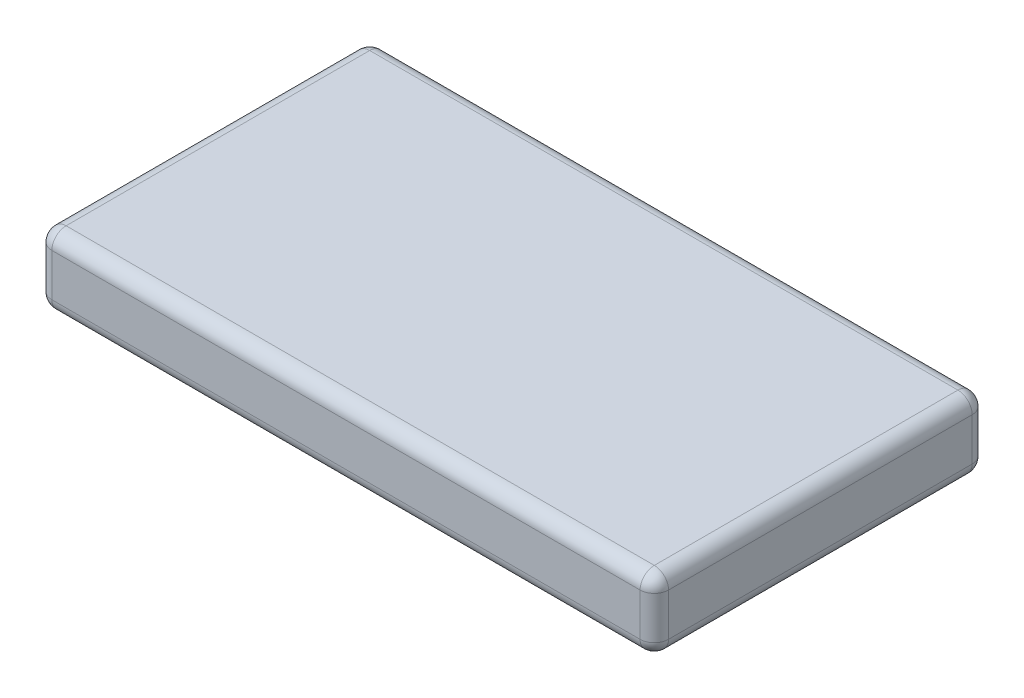
ISO-10303-21;
HEADER;
FILE_DESCRIPTION(('STEP AP214'),'2;1');
FILE_NAME('part.step','',(''),(''),'','','');
FILE_SCHEMA(('AUTOMOTIVE_DESIGN { 1 0 10303 214 1 1 1 1 }'));
ENDSEC;
DATA;
#1=APPLICATION_CONTEXT('core data for automotive mechanical design processes');
#2=APPLICATION_PROTOCOL_DEFINITION('international standard','automotive_design',2000,#1);
#3=PRODUCT_CONTEXT('',#1,'mechanical');
#4=PRODUCT('Part','Part','',(#3));
#5=PRODUCT_RELATED_PRODUCT_CATEGORY('part','',(#4));
#6=PRODUCT_DEFINITION_FORMATION('','',#4);
#7=PRODUCT_DEFINITION_CONTEXT('part definition',#1,'design');
#8=PRODUCT_DEFINITION('design','',#6,#7);
#9=PRODUCT_DEFINITION_SHAPE('','',#8);
#10=(LENGTH_UNIT() NAMED_UNIT(*) SI_UNIT(.MILLI.,.METRE.));
#11=(NAMED_UNIT(*) PLANE_ANGLE_UNIT() SI_UNIT($,.RADIAN.));
#12=(NAMED_UNIT(*) SI_UNIT($,.STERADIAN.) SOLID_ANGLE_UNIT());
#13=UNCERTAINTY_MEASURE_WITH_UNIT(LENGTH_MEASURE(1.E-05),#10,'distance_accuracy_value','');
#14=(GEOMETRIC_REPRESENTATION_CONTEXT(3) GLOBAL_UNCERTAINTY_ASSIGNED_CONTEXT((#13)) GLOBAL_UNIT_ASSIGNED_CONTEXT((#10,
#11,#12)) REPRESENTATION_CONTEXT('',''));
#15=CARTESIAN_POINT('',(0.,0.,0.));
#16=DIRECTION('',(0.,0.,1.));
#17=DIRECTION('',(1.,0.,0.));
#18=AXIS2_PLACEMENT_3D('',#15,#16,#17);
#19=CARTESIAN_POINT('',(65.,15.,-35.));
#20=DIRECTION('',(-1.,0.,0.));
#21=DIRECTION('',(0.,0.,1.));
#22=AXIS2_PLACEMENT_3D('',#19,#20,#21);
#23=PLANE('',#22);
#24=DIRECTION('',(0.,-1.,0.));
#25=VECTOR('',#24,1.);
#26=CARTESIAN_POINT('',(65.,15.,32.));
#27=LINE('',#26,#25);
#28=CARTESIAN_POINT('',(65.,12.,32.));
#29=VERTEX_POINT('',#28);
#30=CARTESIAN_POINT('',(65.,3.,32.));
#31=VERTEX_POINT('',#30);
#32=EDGE_CURVE('E132',#29,#31,#27,.T.);
#33=ORIENTED_EDGE('',*,*,#32,.T.);
#34=DIRECTION('',(0.,0.,-1.));
#35=VECTOR('',#34,1.);
#36=CARTESIAN_POINT('',(65.,3.,-35.));
#37=LINE('',#36,#35);
#38=CARTESIAN_POINT('',(65.,3.,-32.));
#39=VERTEX_POINT('',#38);
#40=EDGE_CURVE('E128',#31,#39,#37,.T.);
#41=ORIENTED_EDGE('',*,*,#40,.T.);
#42=DIRECTION('',(0.,-1.,0.));
#43=VECTOR('',#42,1.);
#44=CARTESIAN_POINT('',(65.,15.,-32.));
#45=LINE('',#44,#43);
#46=CARTESIAN_POINT('',(65.,12.,-32.));
#47=VERTEX_POINT('',#46);
#48=EDGE_CURVE('E121',#39,#47,#45,.F.);
#49=ORIENTED_EDGE('',*,*,#48,.T.);
#50=DIRECTION('',(0.,0.,-1.));
#51=VECTOR('',#50,1.);
#52=CARTESIAN_POINT('',(65.,12.,35.));
#53=LINE('',#52,#51);
#54=EDGE_CURVE('E125',#47,#29,#53,.F.);
#55=ORIENTED_EDGE('',*,*,#54,.T.);
#56=EDGE_LOOP('',(#33,#41,#49,#55));
#57=FACE_BOUND('',#56,.T.);
#58=ADVANCED_FACE('F33',(#57),#23,.F.);
#59=CARTESIAN_POINT('',(-65.,15.,-35.));
#60=DIRECTION('',(0.,0.,1.));
#61=DIRECTION('',(1.,0.,0.));
#62=AXIS2_PLACEMENT_3D('',#59,#60,#61);
#63=PLANE('',#62);
#64=DIRECTION('',(0.,-1.,0.));
#65=VECTOR('',#64,1.);
#66=CARTESIAN_POINT('',(62.,15.,-35.));
#67=LINE('',#66,#65);
#68=CARTESIAN_POINT('',(62.,12.,-35.));
#69=VERTEX_POINT('',#68);
#70=CARTESIAN_POINT('',(62.,3.,-35.));
#71=VERTEX_POINT('',#70);
#72=EDGE_CURVE('E140',#69,#71,#67,.T.);
#73=ORIENTED_EDGE('',*,*,#72,.T.);
#74=DIRECTION('',(-1.,0.,0.));
#75=VECTOR('',#74,1.);
#76=CARTESIAN_POINT('',(-65.,3.,-35.));
#77=LINE('',#76,#75);
#78=CARTESIAN_POINT('',(-62.,3.,-35.));
#79=VERTEX_POINT('',#78);
#80=EDGE_CURVE('E178',#71,#79,#77,.T.);
#81=ORIENTED_EDGE('',*,*,#80,.T.);
#82=DIRECTION('',(0.,-1.,0.));
#83=VECTOR('',#82,1.);
#84=CARTESIAN_POINT('',(-62.,15.,-35.));
#85=LINE('',#84,#83);
#86=CARTESIAN_POINT('',(-62.,12.,-35.));
#87=VERTEX_POINT('',#86);
#88=EDGE_CURVE('E175',#79,#87,#85,.F.);
#89=ORIENTED_EDGE('',*,*,#88,.T.);
#90=DIRECTION('',(-1.,0.,0.));
#91=VECTOR('',#90,1.);
#92=CARTESIAN_POINT('',(65.,12.,-35.));
#93=LINE('',#92,#91);
#94=EDGE_CURVE('E173',#87,#69,#93,.F.);
#95=ORIENTED_EDGE('',*,*,#94,.T.);
#96=EDGE_LOOP('',(#73,#81,#89,#95));
#97=FACE_BOUND('',#96,.T.);
#98=ADVANCED_FACE('F295',(#97),#63,.F.);
#99=CARTESIAN_POINT('',(-65.,15.,-35.));
#100=DIRECTION('',(1.,0.,0.));
#101=DIRECTION('',(0.,0.,-1.));
#102=AXIS2_PLACEMENT_3D('',#99,#100,#101);
#103=PLANE('',#102);
#104=DIRECTION('',(0.,-1.,0.));
#105=VECTOR('',#104,1.);
#106=CARTESIAN_POINT('',(-65.,15.,-32.));
#107=LINE('',#106,#105);
#108=CARTESIAN_POINT('',(-65.,12.,-32.));
#109=VERTEX_POINT('',#108);
#110=CARTESIAN_POINT('',(-65.,3.,-32.));
#111=VERTEX_POINT('',#110);
#112=EDGE_CURVE('E184',#109,#111,#107,.T.);
#113=ORIENTED_EDGE('',*,*,#112,.T.);
#114=DIRECTION('',(0.,0.,1.));
#115=VECTOR('',#114,1.);
#116=CARTESIAN_POINT('',(-65.,3.,-35.));
#117=LINE('',#116,#115);
#118=CARTESIAN_POINT('',(-65.,3.,32.));
#119=VERTEX_POINT('',#118);
#120=EDGE_CURVE('E187',#111,#119,#117,.T.);
#121=ORIENTED_EDGE('',*,*,#120,.T.);
#122=DIRECTION('',(0.,-1.,0.));
#123=VECTOR('',#122,1.);
#124=CARTESIAN_POINT('',(-65.,15.,32.));
#125=LINE('',#124,#123);
#126=CARTESIAN_POINT('',(-65.,12.,32.));
#127=VERTEX_POINT('',#126);
#128=EDGE_CURVE('E182',#119,#127,#125,.F.);
#129=ORIENTED_EDGE('',*,*,#128,.T.);
#130=DIRECTION('',(0.,0.,1.));
#131=VECTOR('',#130,1.);
#132=CARTESIAN_POINT('',(-65.,12.,-35.));
#133=LINE('',#132,#131);
#134=EDGE_CURVE('E180',#127,#109,#133,.F.);
#135=ORIENTED_EDGE('',*,*,#134,.T.);
#136=EDGE_LOOP('',(#113,#121,#129,#135));
#137=FACE_BOUND('',#136,.T.);
#138=ADVANCED_FACE('F272',(#137),#103,.F.);
#139=CARTESIAN_POINT('',(-65.,15.,35.));
#140=DIRECTION('',(0.,0.,-1.));
#141=DIRECTION('',(-1.,0.,0.));
#142=AXIS2_PLACEMENT_3D('',#139,#140,#141);
#143=PLANE('',#142);
#144=DIRECTION('',(0.,-1.,0.));
#145=VECTOR('',#144,1.);
#146=CARTESIAN_POINT('',(-62.,15.,35.));
#147=LINE('',#146,#145);
#148=CARTESIAN_POINT('',(-62.,12.,35.));
#149=VERTEX_POINT('',#148);
#150=CARTESIAN_POINT('',(-62.,3.,35.));
#151=VERTEX_POINT('',#150);
#152=EDGE_CURVE('E166',#149,#151,#147,.T.);
#153=ORIENTED_EDGE('',*,*,#152,.T.);
#154=DIRECTION('',(1.,0.,0.));
#155=VECTOR('',#154,1.);
#156=CARTESIAN_POINT('',(-65.,3.,35.));
#157=LINE('',#156,#155);
#158=CARTESIAN_POINT('',(62.,3.,35.));
#159=VERTEX_POINT('',#158);
#160=EDGE_CURVE('E171',#151,#159,#157,.T.);
#161=ORIENTED_EDGE('',*,*,#160,.T.);
#162=DIRECTION('',(0.,-1.,0.));
#163=VECTOR('',#162,1.);
#164=CARTESIAN_POINT('',(62.,15.,35.));
#165=LINE('',#164,#163);
#166=CARTESIAN_POINT('',(62.,12.,35.));
#167=VERTEX_POINT('',#166);
#168=EDGE_CURVE('E168',#159,#167,#165,.F.);
#169=ORIENTED_EDGE('',*,*,#168,.T.);
#170=DIRECTION('',(1.,0.,0.));
#171=VECTOR('',#170,1.);
#172=CARTESIAN_POINT('',(-65.,12.,35.));
#173=LINE('',#172,#171);
#174=EDGE_CURVE('E164',#167,#149,#173,.F.);
#175=ORIENTED_EDGE('',*,*,#174,.T.);
#176=EDGE_LOOP('',(#153,#161,#169,#175));
#177=FACE_BOUND('',#176,.T.);
#178=ADVANCED_FACE('F302',(#177),#143,.F.);
#179=CARTESIAN_POINT('',(0.,15.,0.));
#180=DIRECTION('',(0.,1.,0.));
#181=DIRECTION('',(0.,0.,1.));
#182=AXIS2_PLACEMENT_3D('',#179,#180,#181);
#183=PLANE('',#182);
#184=DIRECTION('',(0.,0.,1.));
#185=VECTOR('',#184,1.);
#186=CARTESIAN_POINT('',(-62.,15.,35.));
#187=LINE('',#186,#185);
#188=CARTESIAN_POINT('',(-62.,15.,-32.));
#189=VERTEX_POINT('',#188);
#190=CARTESIAN_POINT('',(-62.,15.,32.));
#191=VERTEX_POINT('',#190);
#192=EDGE_CURVE('E42',#189,#191,#187,.T.);
#193=ORIENTED_EDGE('',*,*,#192,.T.);
#194=DIRECTION('',(1.,0.,0.));
#195=VECTOR('',#194,1.);
#196=CARTESIAN_POINT('',(65.,15.,32.));
#197=LINE('',#196,#195);
#198=CARTESIAN_POINT('',(62.,15.,32.));
#199=VERTEX_POINT('',#198);
#200=EDGE_CURVE('E11',#191,#199,#197,.T.);
#201=ORIENTED_EDGE('',*,*,#200,.T.);
#202=DIRECTION('',(0.,0.,-1.));
#203=VECTOR('',#202,1.);
#204=CARTESIAN_POINT('',(62.,15.,-35.));
#205=LINE('',#204,#203);
#206=CARTESIAN_POINT('',(62.,15.,-32.));
#207=VERTEX_POINT('',#206);
#208=EDGE_CURVE('E198',#199,#207,#205,.T.);
#209=ORIENTED_EDGE('',*,*,#208,.T.);
#210=DIRECTION('',(-1.,0.,0.));
#211=VECTOR('',#210,1.);
#212=CARTESIAN_POINT('',(-65.,15.,-32.));
#213=LINE('',#212,#211);
#214=EDGE_CURVE('E53',#207,#189,#213,.T.);
#215=ORIENTED_EDGE('',*,*,#214,.T.);
#216=EDGE_LOOP('',(#193,#201,#209,#215));
#217=FACE_BOUND('',#216,.T.);
#218=ADVANCED_FACE('F365',(#217),#183,.T.);
#219=CARTESIAN_POINT('',(0.,0.,0.));
#220=DIRECTION('',(0.,1.,0.));
#221=DIRECTION('',(0.,0.,1.));
#222=AXIS2_PLACEMENT_3D('',#219,#220,#221);
#223=PLANE('',#222);
#224=DIRECTION('',(0.,0.,1.));
#225=VECTOR('',#224,1.);
#226=CARTESIAN_POINT('',(-62.,0.,0.));
#227=LINE('',#226,#225);
#228=CARTESIAN_POINT('',(-62.,0.,32.));
#229=VERTEX_POINT('',#228);
#230=CARTESIAN_POINT('',(-62.,0.,-32.));
#231=VERTEX_POINT('',#230);
#232=EDGE_CURVE('E193',#229,#231,#227,.F.);
#233=ORIENTED_EDGE('',*,*,#232,.T.);
#234=DIRECTION('',(-1.,0.,0.));
#235=VECTOR('',#234,1.);
#236=CARTESIAN_POINT('',(0.,0.,-32.));
#237=LINE('',#236,#235);
#238=CARTESIAN_POINT('',(62.,0.,-32.));
#239=VERTEX_POINT('',#238);
#240=EDGE_CURVE('E195',#231,#239,#237,.F.);
#241=ORIENTED_EDGE('',*,*,#240,.T.);
#242=DIRECTION('',(0.,0.,-1.));
#243=VECTOR('',#242,1.);
#244=CARTESIAN_POINT('',(62.,0.,0.));
#245=LINE('',#244,#243);
#246=CARTESIAN_POINT('',(62.,0.,32.));
#247=VERTEX_POINT('',#246);
#248=EDGE_CURVE('E189',#239,#247,#245,.F.);
#249=ORIENTED_EDGE('',*,*,#248,.T.);
#250=DIRECTION('',(1.,0.,0.));
#251=VECTOR('',#250,1.);
#252=CARTESIAN_POINT('',(0.,0.,32.));
#253=LINE('',#252,#251);
#254=EDGE_CURVE('E191',#247,#229,#253,.F.);
#255=ORIENTED_EDGE('',*,*,#254,.T.);
#256=EDGE_LOOP('',(#233,#241,#249,#255));
#257=FACE_BOUND('',#256,.T.);
#258=ADVANCED_FACE('F264',(#257),#223,.F.);
#259=CARTESIAN_POINT('',(-62.,15.,-32.));
#260=DIRECTION('',(0.,-1.,0.));
#261=DIRECTION('',(0.,0.,-1.));
#262=AXIS2_PLACEMENT_3D('',#259,#260,#261);
#263=CYLINDRICAL_SURFACE('',#262,3.);
#264=CARTESIAN_POINT('',(-62.,12.,-32.));
#265=DIRECTION('',(0.,1.,0.));
#266=DIRECTION('',(0.,0.,1.));
#267=AXIS2_PLACEMENT_3D('',#264,#265,#266);
#268=CIRCLE('',#267,3.);
#269=EDGE_CURVE('E37',#87,#109,#268,.T.);
#270=ORIENTED_EDGE('',*,*,#269,.F.);
#271=ORIENTED_EDGE('',*,*,#88,.F.);
#272=CARTESIAN_POINT('',(-62.,3.,-32.));
#273=DIRECTION('',(0.,-1.,0.));
#274=DIRECTION('',(0.,0.,-1.));
#275=AXIS2_PLACEMENT_3D('',#272,#273,#274);
#276=CIRCLE('',#275,3.);
#277=EDGE_CURVE('E160',#111,#79,#276,.T.);
#278=ORIENTED_EDGE('',*,*,#277,.F.);
#279=ORIENTED_EDGE('',*,*,#112,.F.);
#280=EDGE_LOOP('',(#270,#271,#278,#279));
#281=FACE_BOUND('',#280,.T.);
#282=ADVANCED_FACE('F35',(#281),#263,.T.);
#283=CARTESIAN_POINT('',(-62.,12.,-32.));
#284=DIRECTION('',(0.,0.,1.));
#285=DIRECTION('',(1.,0.,0.));
#286=AXIS2_PLACEMENT_3D('',#283,#284,#285);
#287=SPHERICAL_SURFACE('',#286,3.);
#288=CARTESIAN_POINT('',(-62.,12.,-32.));
#289=DIRECTION('',(-1.,0.,0.));
#290=DIRECTION('',(0.,0.,1.));
#291=AXIS2_PLACEMENT_3D('',#288,#289,#290);
#292=CIRCLE('',#291,3.);
#293=EDGE_CURVE('E245',#87,#189,#292,.F.);
#294=ORIENTED_EDGE('',*,*,#293,.F.);
#295=ORIENTED_EDGE('',*,*,#269,.T.);
#296=CARTESIAN_POINT('',(-62.,12.,-32.));
#297=DIRECTION('',(0.,0.,-1.));
#298=DIRECTION('',(-1.,0.,0.));
#299=AXIS2_PLACEMENT_3D('',#296,#297,#298);
#300=CIRCLE('',#299,3.);
#301=EDGE_CURVE('E247',#189,#109,#300,.F.);
#302=ORIENTED_EDGE('',*,*,#301,.F.);
#303=EDGE_LOOP('',(#294,#295,#302));
#304=FACE_BOUND('',#303,.T.);
#305=ADVANCED_FACE('F290',(#304),#287,.T.);
#306=CARTESIAN_POINT('',(-62.,3.,-32.));
#307=DIRECTION('',(0.,0.,1.));
#308=DIRECTION('',(1.,0.,0.));
#309=AXIS2_PLACEMENT_3D('',#306,#307,#308);
#310=SPHERICAL_SURFACE('',#309,3.);
#311=CARTESIAN_POINT('',(-62.,3.,-32.));
#312=DIRECTION('',(0.,0.,-1.));
#313=DIRECTION('',(-1.,0.,0.));
#314=AXIS2_PLACEMENT_3D('',#311,#312,#313);
#315=CIRCLE('',#314,3.);
#316=EDGE_CURVE('E239',#111,#231,#315,.F.);
#317=ORIENTED_EDGE('',*,*,#316,.F.);
#318=ORIENTED_EDGE('',*,*,#277,.T.);
#319=CARTESIAN_POINT('',(-62.,3.,-32.));
#320=DIRECTION('',(-1.,0.,0.));
#321=DIRECTION('',(0.,0.,1.));
#322=AXIS2_PLACEMENT_3D('',#319,#320,#321);
#323=CIRCLE('',#322,3.);
#324=EDGE_CURVE('E242',#231,#79,#323,.F.);
#325=ORIENTED_EDGE('',*,*,#324,.F.);
#326=EDGE_LOOP('',(#317,#318,#325));
#327=FACE_BOUND('',#326,.T.);
#328=ADVANCED_FACE('F254',(#327),#310,.T.);
#329=CARTESIAN_POINT('',(-62.,12.,0.));
#330=DIRECTION('',(0.,0.,-1.));
#331=DIRECTION('',(-1.,0.,0.));
#332=AXIS2_PLACEMENT_3D('',#329,#330,#331);
#333=CYLINDRICAL_SURFACE('',#332,3.);
#334=ORIENTED_EDGE('',*,*,#301,.T.);
#335=ORIENTED_EDGE('',*,*,#134,.F.);
#336=CARTESIAN_POINT('',(-62.,12.,32.));
#337=DIRECTION('',(0.,0.,1.));
#338=DIRECTION('',(1.,0.,0.));
#339=AXIS2_PLACEMENT_3D('',#336,#337,#338);
#340=CIRCLE('',#339,3.);
#341=EDGE_CURVE('E233',#191,#127,#340,.T.);
#342=ORIENTED_EDGE('',*,*,#341,.F.);
#343=ORIENTED_EDGE('',*,*,#192,.F.);
#344=EDGE_LOOP('',(#334,#335,#342,#343));
#345=FACE_BOUND('',#344,.T.);
#346=ADVANCED_FACE('F285',(#345),#333,.T.);
#347=CARTESIAN_POINT('',(0.,12.,-32.));
#348=DIRECTION('',(1.,0.,0.));
#349=DIRECTION('',(0.,0.,-1.));
#350=AXIS2_PLACEMENT_3D('',#347,#348,#349);
#351=CYLINDRICAL_SURFACE('',#350,3.);
#352=ORIENTED_EDGE('',*,*,#293,.T.);
#353=ORIENTED_EDGE('',*,*,#214,.F.);
#354=CARTESIAN_POINT('',(62.,12.,-32.));
#355=DIRECTION('',(1.,0.,0.));
#356=DIRECTION('',(0.,1.,0.));
#357=AXIS2_PLACEMENT_3D('',#354,#355,#356);
#358=CIRCLE('',#357,3.);
#359=EDGE_CURVE('E144',#69,#207,#358,.T.);
#360=ORIENTED_EDGE('',*,*,#359,.F.);
#361=ORIENTED_EDGE('',*,*,#94,.F.);
#362=EDGE_LOOP('',(#352,#353,#360,#361));
#363=FACE_BOUND('',#362,.T.);
#364=ADVANCED_FACE('F293',(#363),#351,.T.);
#365=CARTESIAN_POINT('',(62.,15.,-32.));
#366=DIRECTION('',(0.,-1.,0.));
#367=DIRECTION('',(0.,0.,-1.));
#368=AXIS2_PLACEMENT_3D('',#365,#366,#367);
#369=CYLINDRICAL_SURFACE('',#368,3.);
#370=CARTESIAN_POINT('',(62.,3.,-32.));
#371=DIRECTION('',(0.,-1.,0.));
#372=DIRECTION('',(0.,0.,-1.));
#373=AXIS2_PLACEMENT_3D('',#370,#371,#372);
#374=CIRCLE('',#373,3.);
#375=EDGE_CURVE('E145',#71,#39,#374,.T.);
#376=ORIENTED_EDGE('',*,*,#375,.F.);
#377=ORIENTED_EDGE('',*,*,#72,.F.);
#378=CARTESIAN_POINT('',(62.,12.,-32.));
#379=DIRECTION('',(0.,1.,0.));
#380=DIRECTION('',(0.,0.,1.));
#381=AXIS2_PLACEMENT_3D('',#378,#379,#380);
#382=CIRCLE('',#381,3.);
#383=EDGE_CURVE('E136',#47,#69,#382,.T.);
#384=ORIENTED_EDGE('',*,*,#383,.F.);
#385=ORIENTED_EDGE('',*,*,#48,.F.);
#386=EDGE_LOOP('',(#376,#377,#384,#385));
#387=FACE_BOUND('',#386,.T.);
#388=ADVANCED_FACE('F138',(#387),#369,.T.);
#389=CARTESIAN_POINT('',(-65.,3.,-32.));
#390=DIRECTION('',(-1.,0.,0.));
#391=DIRECTION('',(0.,0.,1.));
#392=AXIS2_PLACEMENT_3D('',#389,#390,#391);
#393=CYLINDRICAL_SURFACE('',#392,3.);
#394=ORIENTED_EDGE('',*,*,#324,.T.);
#395=ORIENTED_EDGE('',*,*,#80,.F.);
#396=CARTESIAN_POINT('',(62.,3.,-32.));
#397=DIRECTION('',(1.,0.,0.));
#398=DIRECTION('',(0.,0.,-1.));
#399=AXIS2_PLACEMENT_3D('',#396,#397,#398);
#400=CIRCLE('',#399,3.);
#401=EDGE_CURVE('E229',#239,#71,#400,.T.);
#402=ORIENTED_EDGE('',*,*,#401,.F.);
#403=ORIENTED_EDGE('',*,*,#240,.F.);
#404=EDGE_LOOP('',(#394,#395,#402,#403));
#405=FACE_BOUND('',#404,.T.);
#406=ADVANCED_FACE('F261',(#405),#393,.T.);
#407=CARTESIAN_POINT('',(-62.,3.,-35.));
#408=DIRECTION('',(0.,0.,1.));
#409=DIRECTION('',(1.,0.,0.));
#410=AXIS2_PLACEMENT_3D('',#407,#408,#409);
#411=CYLINDRICAL_SURFACE('',#410,3.);
#412=ORIENTED_EDGE('',*,*,#316,.T.);
#413=ORIENTED_EDGE('',*,*,#232,.F.);
#414=CARTESIAN_POINT('',(-62.,3.,32.));
#415=DIRECTION('',(0.,0.,1.));
#416=DIRECTION('',(1.,0.,0.));
#417=AXIS2_PLACEMENT_3D('',#414,#415,#416);
#418=CIRCLE('',#417,3.);
#419=EDGE_CURVE('E226',#119,#229,#418,.T.);
#420=ORIENTED_EDGE('',*,*,#419,.F.);
#421=ORIENTED_EDGE('',*,*,#120,.F.);
#422=EDGE_LOOP('',(#412,#413,#420,#421));
#423=FACE_BOUND('',#422,.T.);
#424=ADVANCED_FACE('F269',(#423),#411,.T.);
#425=CARTESIAN_POINT('',(-62.,15.,32.));
#426=DIRECTION('',(0.,-1.,0.));
#427=DIRECTION('',(0.,0.,-1.));
#428=AXIS2_PLACEMENT_3D('',#425,#426,#427);
#429=CYLINDRICAL_SURFACE('',#428,3.);
#430=CARTESIAN_POINT('',(-62.,12.,32.));
#431=DIRECTION('',(0.,1.,0.));
#432=DIRECTION('',(0.,0.,1.));
#433=AXIS2_PLACEMENT_3D('',#430,#431,#432);
#434=CIRCLE('',#433,3.);
#435=EDGE_CURVE('E236',#127,#149,#434,.T.);
#436=ORIENTED_EDGE('',*,*,#435,.F.);
#437=ORIENTED_EDGE('',*,*,#128,.F.);
#438=CARTESIAN_POINT('',(-62.,3.,32.));
#439=DIRECTION('',(0.,-1.,0.));
#440=DIRECTION('',(0.,0.,-1.));
#441=AXIS2_PLACEMENT_3D('',#438,#439,#440);
#442=CIRCLE('',#441,3.);
#443=EDGE_CURVE('E223',#151,#119,#442,.T.);
#444=ORIENTED_EDGE('',*,*,#443,.F.);
#445=ORIENTED_EDGE('',*,*,#152,.F.);
#446=EDGE_LOOP('',(#436,#437,#444,#445));
#447=FACE_BOUND('',#446,.T.);
#448=ADVANCED_FACE('F277',(#447),#429,.T.);
#449=CARTESIAN_POINT('',(-62.,12.,32.));
#450=DIRECTION('',(0.,0.,1.));
#451=DIRECTION('',(1.,0.,0.));
#452=AXIS2_PLACEMENT_3D('',#449,#450,#451);
#453=SPHERICAL_SURFACE('',#452,3.);
#454=ORIENTED_EDGE('',*,*,#341,.T.);
#455=ORIENTED_EDGE('',*,*,#435,.T.);
#456=CARTESIAN_POINT('',(-62.,12.,32.));
#457=DIRECTION('',(-1.,0.,0.));
#458=DIRECTION('',(0.,0.,1.));
#459=AXIS2_PLACEMENT_3D('',#456,#457,#458);
#460=CIRCLE('',#459,3.);
#461=EDGE_CURVE('E152',#191,#149,#460,.F.);
#462=ORIENTED_EDGE('',*,*,#461,.F.);
#463=EDGE_LOOP('',(#454,#455,#462));
#464=FACE_BOUND('',#463,.T.);
#465=ADVANCED_FACE('F282',(#464),#453,.T.);
#466=CARTESIAN_POINT('',(62.,12.,-32.));
#467=DIRECTION('',(0.,0.,1.));
#468=DIRECTION('',(1.,0.,0.));
#469=AXIS2_PLACEMENT_3D('',#466,#467,#468);
#470=SPHERICAL_SURFACE('',#469,3.);
#471=ORIENTED_EDGE('',*,*,#383,.T.);
#472=ORIENTED_EDGE('',*,*,#359,.T.);
#473=CARTESIAN_POINT('',(62.,12.,-32.));
#474=DIRECTION('',(0.,0.,-1.));
#475=DIRECTION('',(-1.,0.,0.));
#476=AXIS2_PLACEMENT_3D('',#473,#474,#475);
#477=CIRCLE('',#476,3.);
#478=EDGE_CURVE('E148',#47,#207,#477,.F.);
#479=ORIENTED_EDGE('',*,*,#478,.F.);
#480=EDGE_LOOP('',(#471,#472,#479));
#481=FACE_BOUND('',#480,.T.);
#482=ADVANCED_FACE('F149',(#481),#470,.T.);
#483=CARTESIAN_POINT('',(62.,3.,-32.));
#484=DIRECTION('',(0.,0.,1.));
#485=DIRECTION('',(1.,0.,0.));
#486=AXIS2_PLACEMENT_3D('',#483,#484,#485);
#487=SPHERICAL_SURFACE('',#486,3.);
#488=ORIENTED_EDGE('',*,*,#401,.T.);
#489=ORIENTED_EDGE('',*,*,#375,.T.);
#490=CARTESIAN_POINT('',(62.,3.,-32.));
#491=DIRECTION('',(0.,0.,-1.));
#492=DIRECTION('',(-1.,0.,0.));
#493=AXIS2_PLACEMENT_3D('',#490,#491,#492);
#494=CIRCLE('',#493,3.);
#495=EDGE_CURVE('E153',#239,#39,#494,.F.);
#496=ORIENTED_EDGE('',*,*,#495,.F.);
#497=EDGE_LOOP('',(#488,#489,#496));
#498=FACE_BOUND('',#497,.T.);
#499=ADVANCED_FACE('F336',(#498),#487,.T.);
#500=CARTESIAN_POINT('',(-62.,3.,32.));
#501=DIRECTION('',(0.,0.,1.));
#502=DIRECTION('',(1.,0.,0.));
#503=AXIS2_PLACEMENT_3D('',#500,#501,#502);
#504=SPHERICAL_SURFACE('',#503,3.);
#505=ORIENTED_EDGE('',*,*,#443,.T.);
#506=ORIENTED_EDGE('',*,*,#419,.T.);
#507=CARTESIAN_POINT('',(-62.,3.,32.));
#508=DIRECTION('',(-1.,0.,0.));
#509=DIRECTION('',(0.,0.,1.));
#510=AXIS2_PLACEMENT_3D('',#507,#508,#509);
#511=CIRCLE('',#510,3.);
#512=EDGE_CURVE('E216',#151,#229,#511,.F.);
#513=ORIENTED_EDGE('',*,*,#512,.F.);
#514=EDGE_LOOP('',(#505,#506,#513));
#515=FACE_BOUND('',#514,.T.);
#516=ADVANCED_FACE('F332',(#515),#504,.T.);
#517=CARTESIAN_POINT('',(0.,12.,32.));
#518=DIRECTION('',(-1.,0.,0.));
#519=DIRECTION('',(0.,0.,1.));
#520=AXIS2_PLACEMENT_3D('',#517,#518,#519);
#521=CYLINDRICAL_SURFACE('',#520,3.);
#522=ORIENTED_EDGE('',*,*,#461,.T.);
#523=ORIENTED_EDGE('',*,*,#174,.F.);
#524=CARTESIAN_POINT('',(62.,12.,32.));
#525=DIRECTION('',(1.,0.,0.));
#526=DIRECTION('',(0.,0.,-1.));
#527=AXIS2_PLACEMENT_3D('',#524,#525,#526);
#528=CIRCLE('',#527,3.);
#529=EDGE_CURVE('E213',#199,#167,#528,.T.);
#530=ORIENTED_EDGE('',*,*,#529,.F.);
#531=ORIENTED_EDGE('',*,*,#200,.F.);
#532=EDGE_LOOP('',(#522,#523,#530,#531));
#533=FACE_BOUND('',#532,.T.);
#534=ADVANCED_FACE('F329',(#533),#521,.T.);
#535=CARTESIAN_POINT('',(62.,12.,0.));
#536=DIRECTION('',(0.,0.,1.));
#537=DIRECTION('',(1.,0.,0.));
#538=AXIS2_PLACEMENT_3D('',#535,#536,#537);
#539=CYLINDRICAL_SURFACE('',#538,3.);
#540=ORIENTED_EDGE('',*,*,#478,.T.);
#541=ORIENTED_EDGE('',*,*,#208,.F.);
#542=CARTESIAN_POINT('',(62.,12.,32.));
#543=DIRECTION('',(0.,0.,1.));
#544=DIRECTION('',(1.,0.,0.));
#545=AXIS2_PLACEMENT_3D('',#542,#543,#544);
#546=CIRCLE('',#545,3.);
#547=EDGE_CURVE('E156',#29,#199,#546,.T.);
#548=ORIENTED_EDGE('',*,*,#547,.F.);
#549=ORIENTED_EDGE('',*,*,#54,.F.);
#550=EDGE_LOOP('',(#540,#541,#548,#549));
#551=FACE_BOUND('',#550,.T.);
#552=ADVANCED_FACE('F155',(#551),#539,.T.);
#553=CARTESIAN_POINT('',(62.,3.,-35.));
#554=DIRECTION('',(0.,0.,-1.));
#555=DIRECTION('',(-1.,0.,0.));
#556=AXIS2_PLACEMENT_3D('',#553,#554,#555);
#557=CYLINDRICAL_SURFACE('',#556,3.);
#558=ORIENTED_EDGE('',*,*,#495,.T.);
#559=ORIENTED_EDGE('',*,*,#40,.F.);
#560=CARTESIAN_POINT('',(62.,3.,32.));
#561=DIRECTION('',(0.,0.,1.));
#562=DIRECTION('',(1.,0.,0.));
#563=AXIS2_PLACEMENT_3D('',#560,#561,#562);
#564=CIRCLE('',#563,3.);
#565=EDGE_CURVE('E209',#247,#31,#564,.T.);
#566=ORIENTED_EDGE('',*,*,#565,.F.);
#567=ORIENTED_EDGE('',*,*,#248,.F.);
#568=EDGE_LOOP('',(#558,#559,#566,#567));
#569=FACE_BOUND('',#568,.T.);
#570=ADVANCED_FACE('F322',(#569),#557,.T.);
#571=CARTESIAN_POINT('',(-65.,3.,32.));
#572=DIRECTION('',(1.,0.,0.));
#573=DIRECTION('',(0.,0.,-1.));
#574=AXIS2_PLACEMENT_3D('',#571,#572,#573);
#575=CYLINDRICAL_SURFACE('',#574,3.);
#576=ORIENTED_EDGE('',*,*,#512,.T.);
#577=ORIENTED_EDGE('',*,*,#254,.F.);
#578=CARTESIAN_POINT('',(62.,3.,32.));
#579=DIRECTION('',(1.,0.,0.));
#580=DIRECTION('',(0.,0.,-1.));
#581=AXIS2_PLACEMENT_3D('',#578,#579,#580);
#582=CIRCLE('',#581,3.);
#583=EDGE_CURVE('E206',#159,#247,#582,.T.);
#584=ORIENTED_EDGE('',*,*,#583,.F.);
#585=ORIENTED_EDGE('',*,*,#160,.F.);
#586=EDGE_LOOP('',(#576,#577,#584,#585));
#587=FACE_BOUND('',#586,.T.);
#588=ADVANCED_FACE('F318',(#587),#575,.T.);
#589=CARTESIAN_POINT('',(62.,12.,32.));
#590=DIRECTION('',(0.,0.,1.));
#591=DIRECTION('',(1.,0.,0.));
#592=AXIS2_PLACEMENT_3D('',#589,#590,#591);
#593=SPHERICAL_SURFACE('',#592,3.);
#594=ORIENTED_EDGE('',*,*,#547,.T.);
#595=ORIENTED_EDGE('',*,*,#529,.T.);
#596=CARTESIAN_POINT('',(62.,12.,32.));
#597=DIRECTION('',(0.,1.,0.));
#598=DIRECTION('',(0.,0.,1.));
#599=AXIS2_PLACEMENT_3D('',#596,#597,#598);
#600=CIRCLE('',#599,3.);
#601=EDGE_CURVE('E204',#29,#167,#600,.F.);
#602=ORIENTED_EDGE('',*,*,#601,.F.);
#603=EDGE_LOOP('',(#594,#595,#602));
#604=FACE_BOUND('',#603,.T.);
#605=ADVANCED_FACE('F314',(#604),#593,.T.);
#606=CARTESIAN_POINT('',(62.,3.,32.));
#607=DIRECTION('',(0.,0.,1.));
#608=DIRECTION('',(1.,0.,0.));
#609=AXIS2_PLACEMENT_3D('',#606,#607,#608);
#610=SPHERICAL_SURFACE('',#609,3.);
#611=ORIENTED_EDGE('',*,*,#583,.T.);
#612=ORIENTED_EDGE('',*,*,#565,.T.);
#613=CARTESIAN_POINT('',(62.,3.,32.));
#614=DIRECTION('',(0.,-1.,0.));
#615=DIRECTION('',(0.,0.,-1.));
#616=AXIS2_PLACEMENT_3D('',#613,#614,#615);
#617=CIRCLE('',#616,3.);
#618=EDGE_CURVE('E202',#159,#31,#617,.F.);
#619=ORIENTED_EDGE('',*,*,#618,.F.);
#620=EDGE_LOOP('',(#611,#612,#619));
#621=FACE_BOUND('',#620,.T.);
#622=ADVANCED_FACE('F310',(#621),#610,.T.);
#623=CARTESIAN_POINT('',(62.,15.,32.));
#624=DIRECTION('',(0.,-1.,0.));
#625=DIRECTION('',(0.,0.,-1.));
#626=AXIS2_PLACEMENT_3D('',#623,#624,#625);
#627=CYLINDRICAL_SURFACE('',#626,3.);
#628=ORIENTED_EDGE('',*,*,#601,.T.);
#629=ORIENTED_EDGE('',*,*,#168,.F.);
#630=ORIENTED_EDGE('',*,*,#618,.T.);
#631=ORIENTED_EDGE('',*,*,#32,.F.);
#632=EDGE_LOOP('',(#628,#629,#630,#631));
#633=FACE_BOUND('',#632,.T.);
#634=ADVANCED_FACE('F307',(#633),#627,.T.);
#635=CLOSED_SHELL('',(#58,#98,#138,#178,#218,#258,#282,#305,#328,#346,#364,#388,#406,#424,#448,
#465,#482,#499,#516,#534,#552,#570,#588,#605,#622,#634));
#636=MANIFOLD_SOLID_BREP('B2',#635);
#637=ADVANCED_BREP_SHAPE_REPRESENTATION('',(#18,#636),#14);
#638=SHAPE_DEFINITION_REPRESENTATION(#9,#637);
ENDSEC;
END-ISO-10303-21;
